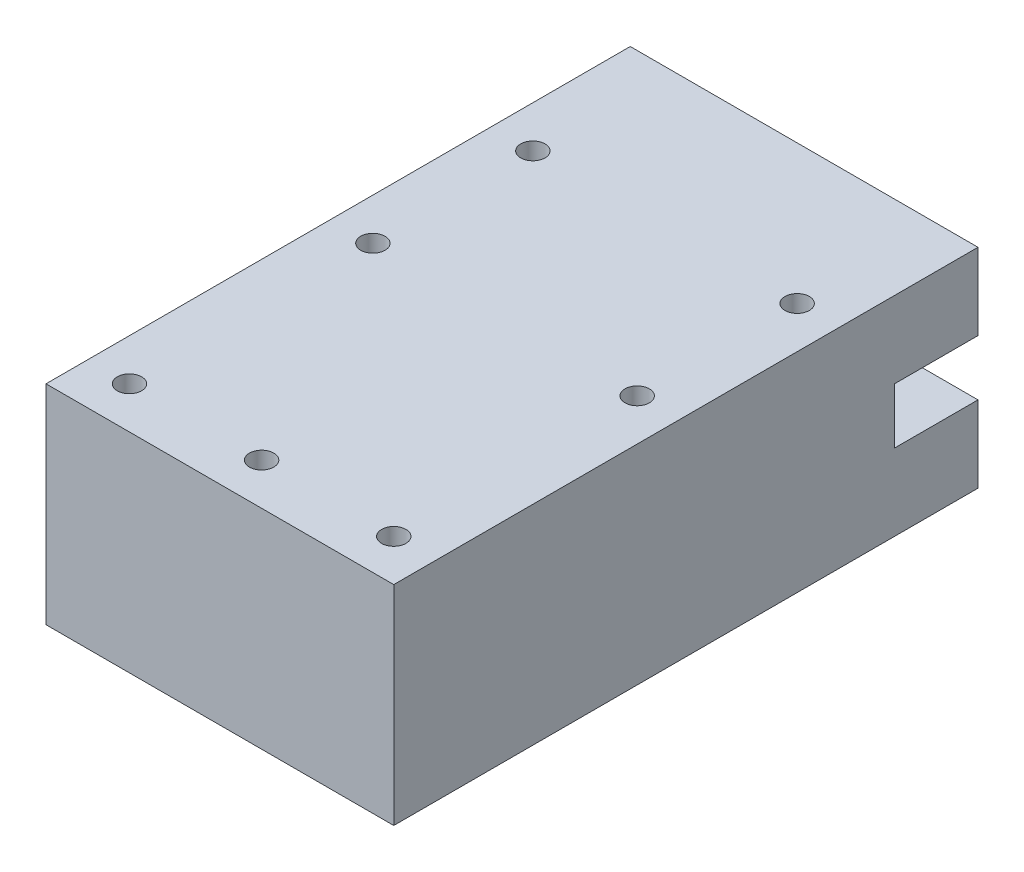
ISO-10303-21;
HEADER;
FILE_DESCRIPTION(('STEP AP214'),'2;1');
FILE_NAME('part.step','',(''),(''),'','','');
FILE_SCHEMA(('AUTOMOTIVE_DESIGN { 1 0 10303 214 1 1 1 1 }'));
ENDSEC;
DATA;
#1=APPLICATION_CONTEXT('core data for automotive mechanical design processes');
#2=APPLICATION_PROTOCOL_DEFINITION('international standard','automotive_design',2000,#1);
#3=PRODUCT_CONTEXT('',#1,'mechanical');
#4=PRODUCT('Part','Part','',(#3));
#5=PRODUCT_RELATED_PRODUCT_CATEGORY('part','',(#4));
#6=PRODUCT_DEFINITION_FORMATION('','',#4);
#7=PRODUCT_DEFINITION_CONTEXT('part definition',#1,'design');
#8=PRODUCT_DEFINITION('design','',#6,#7);
#9=PRODUCT_DEFINITION_SHAPE('','',#8);
#10=(LENGTH_UNIT() NAMED_UNIT(*) SI_UNIT(.MILLI.,.METRE.));
#11=(NAMED_UNIT(*) PLANE_ANGLE_UNIT() SI_UNIT($,.RADIAN.));
#12=(NAMED_UNIT(*) SI_UNIT($,.STERADIAN.) SOLID_ANGLE_UNIT());
#13=UNCERTAINTY_MEASURE_WITH_UNIT(LENGTH_MEASURE(1.E-05),#10,'distance_accuracy_value','');
#14=(GEOMETRIC_REPRESENTATION_CONTEXT(3) GLOBAL_UNCERTAINTY_ASSIGNED_CONTEXT((#13)) GLOBAL_UNIT_ASSIGNED_CONTEXT((#10,
#11,#12)) REPRESENTATION_CONTEXT('',''));
#15=CARTESIAN_POINT('',(0.,0.,0.));
#16=DIRECTION('',(0.,0.,1.));
#17=DIRECTION('',(1.,0.,0.));
#18=AXIS2_PLACEMENT_3D('',#15,#16,#17);
#19=CARTESIAN_POINT('',(0.,0.,0.));
#20=DIRECTION('',(0.,0.,1.));
#21=DIRECTION('',(1.,0.,0.));
#22=AXIS2_PLACEMENT_3D('',#19,#20,#21);
#23=PLANE('',#22);
#24=DIRECTION('',(0.,-1.,0.));
#25=VECTOR('',#24,1.);
#26=CARTESIAN_POINT('',(-25.,15.,0.));
#27=LINE('',#26,#25);
#28=CARTESIAN_POINT('',(-25.,-4.,0.));
#29=VERTEX_POINT('',#28);
#30=CARTESIAN_POINT('',(-25.,-15.,0.));
#31=VERTEX_POINT('',#30);
#32=EDGE_CURVE('E171',#29,#31,#27,.T.);
#33=ORIENTED_EDGE('',*,*,#32,.F.);
#34=DIRECTION('',(1.,0.,0.));
#35=VECTOR('',#34,1.);
#36=CARTESIAN_POINT('',(-25.,-4.,0.));
#37=LINE('',#36,#35);
#38=CARTESIAN_POINT('',(-13.,-4.,0.));
#39=VERTEX_POINT('',#38);
#40=EDGE_CURVE('E261',#29,#39,#37,.T.);
#41=ORIENTED_EDGE('',*,*,#40,.T.);
#42=DIRECTION('',(0.,1.,0.));
#43=VECTOR('',#42,1.);
#44=CARTESIAN_POINT('',(-13.,7.,0.));
#45=LINE('',#44,#43);
#46=CARTESIAN_POINT('',(-13.,-7.,0.));
#47=VERTEX_POINT('',#46);
#48=EDGE_CURVE('E224',#47,#39,#45,.T.);
#49=ORIENTED_EDGE('',*,*,#48,.F.);
#50=DIRECTION('',(-1.,0.,0.));
#51=VECTOR('',#50,1.);
#52=CARTESIAN_POINT('',(-13.,-7.,0.));
#53=LINE('',#52,#51);
#54=CARTESIAN_POINT('',(13.,-7.,0.));
#55=VERTEX_POINT('',#54);
#56=EDGE_CURVE('E227',#55,#47,#53,.T.);
#57=ORIENTED_EDGE('',*,*,#56,.F.);
#58=DIRECTION('',(0.,-1.,0.));
#59=VECTOR('',#58,1.);
#60=CARTESIAN_POINT('',(13.,7.,0.));
#61=LINE('',#60,#59);
#62=CARTESIAN_POINT('',(13.,-4.,0.));
#63=VERTEX_POINT('',#62);
#64=EDGE_CURVE('E233',#63,#55,#61,.T.);
#65=ORIENTED_EDGE('',*,*,#64,.F.);
#66=DIRECTION('',(-1.,0.,0.));
#67=VECTOR('',#66,1.);
#68=CARTESIAN_POINT('',(25.,-4.,0.));
#69=LINE('',#68,#67);
#70=CARTESIAN_POINT('',(25.,-4.,0.));
#71=VERTEX_POINT('',#70);
#72=EDGE_CURVE('E56',#71,#63,#69,.T.);
#73=ORIENTED_EDGE('',*,*,#72,.F.);
#74=DIRECTION('',(0.,1.,0.));
#75=VECTOR('',#74,1.);
#76=CARTESIAN_POINT('',(25.,15.,0.));
#77=LINE('',#76,#75);
#78=CARTESIAN_POINT('',(25.,-15.,0.));
#79=VERTEX_POINT('',#78);
#80=EDGE_CURVE('E196',#79,#71,#77,.T.);
#81=ORIENTED_EDGE('',*,*,#80,.F.);
#82=DIRECTION('',(1.,0.,0.));
#83=VECTOR('',#82,1.);
#84=CARTESIAN_POINT('',(-25.,-15.,0.));
#85=LINE('',#84,#83);
#86=EDGE_CURVE('E170',#31,#79,#85,.T.);
#87=ORIENTED_EDGE('',*,*,#86,.F.);
#88=EDGE_LOOP('',(#33,#41,#49,#57,#65,#73,#81,#87));
#89=FACE_BOUND('',#88,.T.);
#90=ADVANCED_FACE('F33',(#89),#23,.F.);
#91=CARTESIAN_POINT('',(25.,15.,84.));
#92=DIRECTION('',(-1.,0.,0.));
#93=DIRECTION('',(0.,-1.,0.));
#94=AXIS2_PLACEMENT_3D('',#91,#92,#93);
#95=PLANE('',#94);
#96=DIRECTION('',(0.,1.,0.));
#97=VECTOR('',#96,1.);
#98=CARTESIAN_POINT('',(25.,4.,12.));
#99=LINE('',#98,#97);
#100=CARTESIAN_POINT('',(25.,-4.,12.));
#101=VERTEX_POINT('',#100);
#102=CARTESIAN_POINT('',(25.,4.,12.));
#103=VERTEX_POINT('',#102);
#104=EDGE_CURVE('E264',#101,#103,#99,.T.);
#105=ORIENTED_EDGE('',*,*,#104,.T.);
#106=DIRECTION('',(0.,0.,-1.));
#107=VECTOR('',#106,1.);
#108=CARTESIAN_POINT('',(25.,4.,0.));
#109=LINE('',#108,#107);
#110=CARTESIAN_POINT('',(25.,4.,0.));
#111=VERTEX_POINT('',#110);
#112=EDGE_CURVE('E246',#103,#111,#109,.T.);
#113=ORIENTED_EDGE('',*,*,#112,.T.);
#114=CARTESIAN_POINT('',(25.,15.,0.));
#115=VERTEX_POINT('',#114);
#116=EDGE_CURVE('E200',#111,#115,#77,.T.);
#117=ORIENTED_EDGE('',*,*,#116,.T.);
#118=DIRECTION('',(0.,0.,-1.));
#119=VECTOR('',#118,1.);
#120=CARTESIAN_POINT('',(25.,15.,84.));
#121=LINE('',#120,#119);
#122=CARTESIAN_POINT('',(25.,15.,84.));
#123=VERTEX_POINT('',#122);
#124=EDGE_CURVE('E11',#123,#115,#121,.T.);
#125=ORIENTED_EDGE('',*,*,#124,.F.);
#126=DIRECTION('',(0.,1.,0.));
#127=VECTOR('',#126,1.);
#128=CARTESIAN_POINT('',(25.,15.,84.));
#129=LINE('',#128,#127);
#130=CARTESIAN_POINT('',(25.,-15.,84.));
#131=VERTEX_POINT('',#130);
#132=EDGE_CURVE('E173',#131,#123,#129,.T.);
#133=ORIENTED_EDGE('',*,*,#132,.F.);
#134=DIRECTION('',(0.,0.,-1.));
#135=VECTOR('',#134,1.);
#136=CARTESIAN_POINT('',(25.,-15.,84.));
#137=LINE('',#136,#135);
#138=EDGE_CURVE('E179',#131,#79,#137,.T.);
#139=ORIENTED_EDGE('',*,*,#138,.T.);
#140=ORIENTED_EDGE('',*,*,#80,.T.);
#141=DIRECTION('',(0.,0.,1.));
#142=VECTOR('',#141,1.);
#143=CARTESIAN_POINT('',(25.,-4.,0.));
#144=LINE('',#143,#142);
#145=EDGE_CURVE('E255',#71,#101,#144,.T.);
#146=ORIENTED_EDGE('',*,*,#145,.T.);
#147=EDGE_LOOP('',(#105,#113,#117,#125,#133,#139,#140,#146));
#148=FACE_BOUND('',#147,.T.);
#149=ADVANCED_FACE('F35',(#148),#95,.F.);
#150=CARTESIAN_POINT('',(-25.,15.,84.));
#151=DIRECTION('',(0.,-1.,0.));
#152=DIRECTION('',(0.,0.,-1.));
#153=AXIS2_PLACEMENT_3D('',#150,#151,#152);
#154=PLANE('',#153);
#155=CARTESIAN_POINT('',(19.,15.,43.));
#156=DIRECTION('',(0.,1.,0.));
#157=DIRECTION('',(0.,0.,1.));
#158=AXIS2_PLACEMENT_3D('',#155,#156,#157);
#159=CIRCLE('',#158,1.75);
#160=CARTESIAN_POINT('',(19.,15.,44.75));
#161=VERTEX_POINT('',#160);
#162=EDGE_CURVE('E307',#161,#161,#159,.T.);
#163=ORIENTED_EDGE('',*,*,#162,.F.);
#164=EDGE_LOOP('',(#163));
#165=FACE_BOUND('',#164,.T.);
#166=CARTESIAN_POINT('',(19.,15.,78.));
#167=DIRECTION('',(0.,1.,0.));
#168=DIRECTION('',(0.,0.,1.));
#169=AXIS2_PLACEMENT_3D('',#166,#167,#168);
#170=CIRCLE('',#169,1.75);
#171=CARTESIAN_POINT('',(19.,15.,79.75));
#172=VERTEX_POINT('',#171);
#173=EDGE_CURVE('E301',#172,#172,#170,.T.);
#174=ORIENTED_EDGE('',*,*,#173,.F.);
#175=EDGE_LOOP('',(#174));
#176=FACE_BOUND('',#175,.T.);
#177=CARTESIAN_POINT('',(0.,15.,78.));
#178=DIRECTION('',(0.,1.,0.));
#179=DIRECTION('',(0.,0.,1.));
#180=AXIS2_PLACEMENT_3D('',#177,#178,#179);
#181=CIRCLE('',#180,1.75);
#182=CARTESIAN_POINT('',(0.,15.,79.75));
#183=VERTEX_POINT('',#182);
#184=EDGE_CURVE('E295',#183,#183,#181,.T.);
#185=ORIENTED_EDGE('',*,*,#184,.F.);
#186=EDGE_LOOP('',(#185));
#187=FACE_BOUND('',#186,.T.);
#188=CARTESIAN_POINT('',(-19.,15.,78.));
#189=DIRECTION('',(0.,1.,0.));
#190=DIRECTION('',(0.,0.,1.));
#191=AXIS2_PLACEMENT_3D('',#188,#189,#190);
#192=CIRCLE('',#191,1.75);
#193=CARTESIAN_POINT('',(-19.,15.,79.75));
#194=VERTEX_POINT('',#193);
#195=EDGE_CURVE('E288',#194,#194,#192,.T.);
#196=ORIENTED_EDGE('',*,*,#195,.F.);
#197=EDGE_LOOP('',(#196));
#198=FACE_BOUND('',#197,.T.);
#199=CARTESIAN_POINT('',(-19.,15.,43.));
#200=DIRECTION('',(0.,1.,0.));
#201=DIRECTION('',(0.,0.,1.));
#202=AXIS2_PLACEMENT_3D('',#199,#200,#201);
#203=CIRCLE('',#202,1.75);
#204=CARTESIAN_POINT('',(-19.,15.,44.75));
#205=VERTEX_POINT('',#204);
#206=EDGE_CURVE('E318',#205,#205,#203,.T.);
#207=ORIENTED_EDGE('',*,*,#206,.F.);
#208=EDGE_LOOP('',(#207));
#209=FACE_BOUND('',#208,.T.);
#210=CARTESIAN_POINT('',(-19.,15.,20.));
#211=DIRECTION('',(0.,1.,0.));
#212=DIRECTION('',(0.,0.,1.));
#213=AXIS2_PLACEMENT_3D('',#210,#211,#212);
#214=CIRCLE('',#213,1.75);
#215=CARTESIAN_POINT('',(-19.,15.,21.75));
#216=VERTEX_POINT('',#215);
#217=EDGE_CURVE('E312',#216,#216,#214,.T.);
#218=ORIENTED_EDGE('',*,*,#217,.F.);
#219=EDGE_LOOP('',(#218));
#220=FACE_BOUND('',#219,.T.);
#221=CARTESIAN_POINT('',(19.,15.,20.));
#222=DIRECTION('',(0.,1.,0.));
#223=DIRECTION('',(0.,0.,1.));
#224=AXIS2_PLACEMENT_3D('',#221,#222,#223);
#225=CIRCLE('',#224,1.75);
#226=CARTESIAN_POINT('',(19.,15.,21.75));
#227=VERTEX_POINT('',#226);
#228=EDGE_CURVE('E282',#227,#227,#225,.T.);
#229=ORIENTED_EDGE('',*,*,#228,.F.);
#230=EDGE_LOOP('',(#229));
#231=FACE_BOUND('',#230,.T.);
#232=DIRECTION('',(-1.,0.,0.));
#233=VECTOR('',#232,1.);
#234=CARTESIAN_POINT('',(-25.,15.,0.));
#235=LINE('',#234,#233);
#236=CARTESIAN_POINT('',(-25.,15.,0.));
#237=VERTEX_POINT('',#236);
#238=EDGE_CURVE('E175',#115,#237,#235,.T.);
#239=ORIENTED_EDGE('',*,*,#238,.T.);
#240=DIRECTION('',(0.,0.,-1.));
#241=VECTOR('',#240,1.);
#242=CARTESIAN_POINT('',(-25.,15.,84.));
#243=LINE('',#242,#241);
#244=CARTESIAN_POINT('',(-25.,15.,84.));
#245=VERTEX_POINT('',#244);
#246=EDGE_CURVE('E41',#245,#237,#243,.T.);
#247=ORIENTED_EDGE('',*,*,#246,.F.);
#248=DIRECTION('',(-1.,0.,0.));
#249=VECTOR('',#248,1.);
#250=CARTESIAN_POINT('',(-25.,15.,84.));
#251=LINE('',#250,#249);
#252=EDGE_CURVE('E206',#123,#245,#251,.T.);
#253=ORIENTED_EDGE('',*,*,#252,.F.);
#254=ORIENTED_EDGE('',*,*,#124,.T.);
#255=EDGE_LOOP('',(#239,#247,#253,#254));
#256=FACE_BOUND('',#255,.T.);
#257=ADVANCED_FACE('F334',(#165,#176,#187,#198,#209,#220,#231,#256),#154,.F.);
#258=CARTESIAN_POINT('',(-25.,15.,84.));
#259=DIRECTION('',(1.,0.,0.));
#260=DIRECTION('',(0.,0.,-1.));
#261=AXIS2_PLACEMENT_3D('',#258,#259,#260);
#262=PLANE('',#261);
#263=DIRECTION('',(0.,-1.,0.));
#264=VECTOR('',#263,1.);
#265=CARTESIAN_POINT('',(-25.,4.,12.));
#266=LINE('',#265,#264);
#267=CARTESIAN_POINT('',(-25.,4.,12.));
#268=VERTEX_POINT('',#267);
#269=CARTESIAN_POINT('',(-25.,-4.,12.));
#270=VERTEX_POINT('',#269);
#271=EDGE_CURVE('E153',#268,#270,#266,.T.);
#272=ORIENTED_EDGE('',*,*,#271,.T.);
#273=DIRECTION('',(0.,0.,-1.));
#274=VECTOR('',#273,1.);
#275=CARTESIAN_POINT('',(-25.,-4.,0.));
#276=LINE('',#275,#274);
#277=EDGE_CURVE('E164',#270,#29,#276,.T.);
#278=ORIENTED_EDGE('',*,*,#277,.T.);
#279=ORIENTED_EDGE('',*,*,#32,.T.);
#280=DIRECTION('',(0.,0.,-1.));
#281=VECTOR('',#280,1.);
#282=CARTESIAN_POINT('',(-25.,-15.,84.));
#283=LINE('',#282,#281);
#284=CARTESIAN_POINT('',(-25.,-15.,84.));
#285=VERTEX_POINT('',#284);
#286=EDGE_CURVE('E182',#285,#31,#283,.T.);
#287=ORIENTED_EDGE('',*,*,#286,.F.);
#288=DIRECTION('',(0.,-1.,0.));
#289=VECTOR('',#288,1.);
#290=CARTESIAN_POINT('',(-25.,15.,84.));
#291=LINE('',#290,#289);
#292=EDGE_CURVE('E204',#245,#285,#291,.T.);
#293=ORIENTED_EDGE('',*,*,#292,.F.);
#294=ORIENTED_EDGE('',*,*,#246,.T.);
#295=CARTESIAN_POINT('',(-25.,4.,0.));
#296=VERTEX_POINT('',#295);
#297=EDGE_CURVE('E161',#237,#296,#27,.T.);
#298=ORIENTED_EDGE('',*,*,#297,.T.);
#299=DIRECTION('',(0.,0.,1.));
#300=VECTOR('',#299,1.);
#301=CARTESIAN_POINT('',(-25.,4.,0.));
#302=LINE('',#301,#300);
#303=EDGE_CURVE('E146',#296,#268,#302,.T.);
#304=ORIENTED_EDGE('',*,*,#303,.T.);
#305=EDGE_LOOP('',(#272,#278,#279,#287,#293,#294,#298,#304));
#306=FACE_BOUND('',#305,.T.);
#307=ADVANCED_FACE('F167',(#306),#262,.F.);
#308=CARTESIAN_POINT('',(-25.,-15.,84.));
#309=DIRECTION('',(0.,1.,0.));
#310=DIRECTION('',(0.,0.,1.));
#311=AXIS2_PLACEMENT_3D('',#308,#309,#310);
#312=PLANE('',#311);
#313=CARTESIAN_POINT('',(19.,-15.,43.));
#314=DIRECTION('',(0.,1.,0.));
#315=DIRECTION('',(0.,0.,1.));
#316=AXIS2_PLACEMENT_3D('',#313,#314,#315);
#317=CIRCLE('',#316,1.75);
#318=CARTESIAN_POINT('',(19.,-15.,44.75));
#319=VERTEX_POINT('',#318);
#320=EDGE_CURVE('E285',#319,#319,#317,.T.);
#321=ORIENTED_EDGE('',*,*,#320,.T.);
#322=EDGE_LOOP('',(#321));
#323=FACE_BOUND('',#322,.T.);
#324=CARTESIAN_POINT('',(19.,-15.,78.));
#325=DIRECTION('',(0.,1.,0.));
#326=DIRECTION('',(0.,0.,1.));
#327=AXIS2_PLACEMENT_3D('',#324,#325,#326);
#328=CIRCLE('',#327,1.75);
#329=CARTESIAN_POINT('',(19.,-15.,79.75));
#330=VERTEX_POINT('',#329);
#331=EDGE_CURVE('E304',#330,#330,#328,.T.);
#332=ORIENTED_EDGE('',*,*,#331,.T.);
#333=EDGE_LOOP('',(#332));
#334=FACE_BOUND('',#333,.T.);
#335=CARTESIAN_POINT('',(0.,-15.,78.));
#336=DIRECTION('',(0.,1.,0.));
#337=DIRECTION('',(0.,0.,1.));
#338=AXIS2_PLACEMENT_3D('',#335,#336,#337);
#339=CIRCLE('',#338,1.75);
#340=CARTESIAN_POINT('',(0.,-15.,79.75));
#341=VERTEX_POINT('',#340);
#342=EDGE_CURVE('E298',#341,#341,#339,.T.);
#343=ORIENTED_EDGE('',*,*,#342,.T.);
#344=EDGE_LOOP('',(#343));
#345=FACE_BOUND('',#344,.T.);
#346=CARTESIAN_POINT('',(-19.,-15.,78.));
#347=DIRECTION('',(0.,1.,0.));
#348=DIRECTION('',(0.,0.,1.));
#349=AXIS2_PLACEMENT_3D('',#346,#347,#348);
#350=CIRCLE('',#349,1.75);
#351=CARTESIAN_POINT('',(-19.,-15.,79.75));
#352=VERTEX_POINT('',#351);
#353=EDGE_CURVE('E291',#352,#352,#350,.T.);
#354=ORIENTED_EDGE('',*,*,#353,.T.);
#355=EDGE_LOOP('',(#354));
#356=FACE_BOUND('',#355,.T.);
#357=CARTESIAN_POINT('',(-19.,-15.,43.));
#358=DIRECTION('',(0.,1.,0.));
#359=DIRECTION('',(0.,0.,1.));
#360=AXIS2_PLACEMENT_3D('',#357,#358,#359);
#361=CIRCLE('',#360,1.75);
#362=CARTESIAN_POINT('',(-19.,-15.,44.75));
#363=VERTEX_POINT('',#362);
#364=EDGE_CURVE('E292',#363,#363,#361,.T.);
#365=ORIENTED_EDGE('',*,*,#364,.T.);
#366=EDGE_LOOP('',(#365));
#367=FACE_BOUND('',#366,.T.);
#368=CARTESIAN_POINT('',(-19.,-15.,20.));
#369=DIRECTION('',(0.,1.,0.));
#370=DIRECTION('',(0.,0.,1.));
#371=AXIS2_PLACEMENT_3D('',#368,#369,#370);
#372=CIRCLE('',#371,1.75);
#373=CARTESIAN_POINT('',(-19.,-15.,21.75));
#374=VERTEX_POINT('',#373);
#375=EDGE_CURVE('E315',#374,#374,#372,.T.);
#376=ORIENTED_EDGE('',*,*,#375,.T.);
#377=EDGE_LOOP('',(#376));
#378=FACE_BOUND('',#377,.T.);
#379=CARTESIAN_POINT('',(19.,-15.,20.));
#380=DIRECTION('',(0.,1.,0.));
#381=DIRECTION('',(0.,0.,1.));
#382=AXIS2_PLACEMENT_3D('',#379,#380,#381);
#383=CIRCLE('',#382,1.75);
#384=CARTESIAN_POINT('',(19.,-15.,21.75));
#385=VERTEX_POINT('',#384);
#386=EDGE_CURVE('E278',#385,#385,#383,.T.);
#387=ORIENTED_EDGE('',*,*,#386,.T.);
#388=EDGE_LOOP('',(#387));
#389=FACE_BOUND('',#388,.T.);
#390=ORIENTED_EDGE('',*,*,#86,.T.);
#391=ORIENTED_EDGE('',*,*,#138,.F.);
#392=DIRECTION('',(1.,0.,0.));
#393=VECTOR('',#392,1.);
#394=CARTESIAN_POINT('',(-25.,-15.,84.));
#395=LINE('',#394,#393);
#396=EDGE_CURVE('E183',#285,#131,#395,.T.);
#397=ORIENTED_EDGE('',*,*,#396,.F.);
#398=ORIENTED_EDGE('',*,*,#286,.T.);
#399=EDGE_LOOP('',(#390,#391,#397,#398));
#400=FACE_BOUND('',#399,.T.);
#401=ADVANCED_FACE('F189',(#323,#334,#345,#356,#367,#378,#389,#400),#312,.F.);
#402=CARTESIAN_POINT('',(0.,0.,84.));
#403=DIRECTION('',(0.,0.,1.));
#404=DIRECTION('',(1.,0.,0.));
#405=AXIS2_PLACEMENT_3D('',#402,#403,#404);
#406=PLANE('',#405);
#407=ORIENTED_EDGE('',*,*,#132,.T.);
#408=ORIENTED_EDGE('',*,*,#252,.T.);
#409=ORIENTED_EDGE('',*,*,#292,.T.);
#410=ORIENTED_EDGE('',*,*,#396,.T.);
#411=EDGE_LOOP('',(#407,#408,#409,#410));
#412=FACE_BOUND('',#411,.T.);
#413=ADVANCED_FACE('F393',(#412),#406,.T.);
#414=CARTESIAN_POINT('',(-13.,4.,0.));
#415=VERTEX_POINT('',#414);
#416=CARTESIAN_POINT('',(-13.,7.,0.));
#417=VERTEX_POINT('',#416);
#418=EDGE_CURVE('E163',#415,#417,#45,.T.);
#419=ORIENTED_EDGE('',*,*,#418,.F.);
#420=DIRECTION('',(1.,0.,0.));
#421=VECTOR('',#420,1.);
#422=CARTESIAN_POINT('',(-25.,4.,0.));
#423=LINE('',#422,#421);
#424=EDGE_CURVE('E48',#296,#415,#423,.T.);
#425=ORIENTED_EDGE('',*,*,#424,.F.);
#426=ORIENTED_EDGE('',*,*,#297,.F.);
#427=ORIENTED_EDGE('',*,*,#238,.F.);
#428=ORIENTED_EDGE('',*,*,#116,.F.);
#429=DIRECTION('',(-1.,0.,0.));
#430=VECTOR('',#429,1.);
#431=CARTESIAN_POINT('',(25.,4.,0.));
#432=LINE('',#431,#430);
#433=CARTESIAN_POINT('',(13.,4.,0.));
#434=VERTEX_POINT('',#433);
#435=EDGE_CURVE('E250',#111,#434,#432,.T.);
#436=ORIENTED_EDGE('',*,*,#435,.T.);
#437=CARTESIAN_POINT('',(13.,7.,0.));
#438=VERTEX_POINT('',#437);
#439=EDGE_CURVE('E230',#438,#434,#61,.T.);
#440=ORIENTED_EDGE('',*,*,#439,.F.);
#441=DIRECTION('',(1.,0.,0.));
#442=VECTOR('',#441,1.);
#443=CARTESIAN_POINT('',(-13.,7.,0.));
#444=LINE('',#443,#442);
#445=EDGE_CURVE('E220',#417,#438,#444,.T.);
#446=ORIENTED_EDGE('',*,*,#445,.F.);
#447=EDGE_LOOP('',(#419,#425,#426,#427,#428,#436,#440,#446));
#448=FACE_BOUND('',#447,.T.);
#449=ADVANCED_FACE('F159',(#448),#23,.F.);
#450=CARTESIAN_POINT('',(13.,7.,72.));
#451=DIRECTION('',(1.,0.,0.));
#452=DIRECTION('',(0.,1.,0.));
#453=AXIS2_PLACEMENT_3D('',#450,#451,#452);
#454=PLANE('',#453);
#455=ORIENTED_EDGE('',*,*,#439,.T.);
#456=DIRECTION('',(0.,0.,-1.));
#457=VECTOR('',#456,1.);
#458=CARTESIAN_POINT('',(13.,4.,0.));
#459=LINE('',#458,#457);
#460=CARTESIAN_POINT('',(13.,4.,12.));
#461=VERTEX_POINT('',#460);
#462=EDGE_CURVE('E253',#461,#434,#459,.T.);
#463=ORIENTED_EDGE('',*,*,#462,.F.);
#464=DIRECTION('',(0.,1.,0.));
#465=VECTOR('',#464,1.);
#466=CARTESIAN_POINT('',(13.,4.,12.));
#467=LINE('',#466,#465);
#468=CARTESIAN_POINT('',(13.,-4.,12.));
#469=VERTEX_POINT('',#468);
#470=EDGE_CURVE('E256',#469,#461,#467,.T.);
#471=ORIENTED_EDGE('',*,*,#470,.F.);
#472=DIRECTION('',(0.,0.,1.));
#473=VECTOR('',#472,1.);
#474=CARTESIAN_POINT('',(13.,-4.,0.));
#475=LINE('',#474,#473);
#476=EDGE_CURVE('E259',#63,#469,#475,.T.);
#477=ORIENTED_EDGE('',*,*,#476,.F.);
#478=ORIENTED_EDGE('',*,*,#64,.T.);
#479=DIRECTION('',(0.,0.,-1.));
#480=VECTOR('',#479,1.);
#481=CARTESIAN_POINT('',(13.,-7.,72.));
#482=LINE('',#481,#480);
#483=CARTESIAN_POINT('',(13.,-7.,72.));
#484=VERTEX_POINT('',#483);
#485=EDGE_CURVE('E210',#484,#55,#482,.T.);
#486=ORIENTED_EDGE('',*,*,#485,.F.);
#487=DIRECTION('',(0.,-1.,0.));
#488=VECTOR('',#487,1.);
#489=CARTESIAN_POINT('',(13.,7.,72.));
#490=LINE('',#489,#488);
#491=CARTESIAN_POINT('',(13.,7.,72.));
#492=VERTEX_POINT('',#491);
#493=EDGE_CURVE('E223',#492,#484,#490,.T.);
#494=ORIENTED_EDGE('',*,*,#493,.F.);
#495=DIRECTION('',(0.,0.,-1.));
#496=VECTOR('',#495,1.);
#497=CARTESIAN_POINT('',(13.,7.,72.));
#498=LINE('',#497,#496);
#499=EDGE_CURVE('E201',#492,#438,#498,.T.);
#500=ORIENTED_EDGE('',*,*,#499,.T.);
#501=EDGE_LOOP('',(#455,#463,#471,#477,#478,#486,#494,#500));
#502=FACE_BOUND('',#501,.T.);
#503=ADVANCED_FACE('F353',(#502),#454,.F.);
#504=CARTESIAN_POINT('',(-13.,7.,72.));
#505=DIRECTION('',(0.,1.,0.));
#506=DIRECTION('',(-1.,0.,0.));
#507=AXIS2_PLACEMENT_3D('',#504,#505,#506);
#508=PLANE('',#507);
#509=ORIENTED_EDGE('',*,*,#445,.T.);
#510=ORIENTED_EDGE('',*,*,#499,.F.);
#511=DIRECTION('',(1.,0.,0.));
#512=VECTOR('',#511,1.);
#513=CARTESIAN_POINT('',(-13.,7.,72.));
#514=LINE('',#513,#512);
#515=CARTESIAN_POINT('',(-13.,7.,72.));
#516=VERTEX_POINT('',#515);
#517=EDGE_CURVE('E214',#516,#492,#514,.T.);
#518=ORIENTED_EDGE('',*,*,#517,.F.);
#519=DIRECTION('',(0.,0.,-1.));
#520=VECTOR('',#519,1.);
#521=CARTESIAN_POINT('',(-13.,7.,72.));
#522=LINE('',#521,#520);
#523=EDGE_CURVE('E216',#516,#417,#522,.T.);
#524=ORIENTED_EDGE('',*,*,#523,.T.);
#525=EDGE_LOOP('',(#509,#510,#518,#524));
#526=FACE_BOUND('',#525,.T.);
#527=ADVANCED_FACE('F356',(#526),#508,.F.);
#528=CARTESIAN_POINT('',(-13.,7.,72.));
#529=DIRECTION('',(-1.,0.,0.));
#530=DIRECTION('',(0.,-1.,0.));
#531=AXIS2_PLACEMENT_3D('',#528,#529,#530);
#532=PLANE('',#531);
#533=ORIENTED_EDGE('',*,*,#48,.T.);
#534=DIRECTION('',(0.,0.,-1.));
#535=VECTOR('',#534,1.);
#536=CARTESIAN_POINT('',(-13.,-4.,0.));
#537=LINE('',#536,#535);
#538=CARTESIAN_POINT('',(-13.,-4.,12.));
#539=VERTEX_POINT('',#538);
#540=EDGE_CURVE('E154',#539,#39,#537,.T.);
#541=ORIENTED_EDGE('',*,*,#540,.F.);
#542=DIRECTION('',(0.,-1.,0.));
#543=VECTOR('',#542,1.);
#544=CARTESIAN_POINT('',(-13.,4.,12.));
#545=LINE('',#544,#543);
#546=CARTESIAN_POINT('',(-13.,4.,12.));
#547=VERTEX_POINT('',#546);
#548=EDGE_CURVE('E273',#547,#539,#545,.T.);
#549=ORIENTED_EDGE('',*,*,#548,.F.);
#550=DIRECTION('',(0.,0.,1.));
#551=VECTOR('',#550,1.);
#552=CARTESIAN_POINT('',(-13.,4.,0.));
#553=LINE('',#552,#551);
#554=EDGE_CURVE('E276',#415,#547,#553,.T.);
#555=ORIENTED_EDGE('',*,*,#554,.F.);
#556=ORIENTED_EDGE('',*,*,#418,.T.);
#557=ORIENTED_EDGE('',*,*,#523,.F.);
#558=DIRECTION('',(0.,1.,0.));
#559=VECTOR('',#558,1.);
#560=CARTESIAN_POINT('',(-13.,7.,72.));
#561=LINE('',#560,#559);
#562=CARTESIAN_POINT('',(-13.,-7.,72.));
#563=VERTEX_POINT('',#562);
#564=EDGE_CURVE('E236',#563,#516,#561,.T.);
#565=ORIENTED_EDGE('',*,*,#564,.F.);
#566=DIRECTION('',(0.,0.,-1.));
#567=VECTOR('',#566,1.);
#568=CARTESIAN_POINT('',(-13.,-7.,72.));
#569=LINE('',#568,#567);
#570=EDGE_CURVE('E213',#563,#47,#569,.T.);
#571=ORIENTED_EDGE('',*,*,#570,.T.);
#572=EDGE_LOOP('',(#533,#541,#549,#555,#556,#557,#565,#571));
#573=FACE_BOUND('',#572,.T.);
#574=ADVANCED_FACE('F360',(#573),#532,.F.);
#575=CARTESIAN_POINT('',(-13.,-7.,72.));
#576=DIRECTION('',(0.,-1.,0.));
#577=DIRECTION('',(1.,0.,0.));
#578=AXIS2_PLACEMENT_3D('',#575,#576,#577);
#579=PLANE('',#578);
#580=ORIENTED_EDGE('',*,*,#56,.T.);
#581=ORIENTED_EDGE('',*,*,#570,.F.);
#582=DIRECTION('',(-1.,0.,0.));
#583=VECTOR('',#582,1.);
#584=CARTESIAN_POINT('',(-13.,-7.,72.));
#585=LINE('',#584,#583);
#586=EDGE_CURVE('E239',#484,#563,#585,.T.);
#587=ORIENTED_EDGE('',*,*,#586,.F.);
#588=ORIENTED_EDGE('',*,*,#485,.T.);
#589=EDGE_LOOP('',(#580,#581,#587,#588));
#590=FACE_BOUND('',#589,.T.);
#591=ADVANCED_FACE('F365',(#590),#579,.F.);
#592=CARTESIAN_POINT('',(0.,0.,72.));
#593=DIRECTION('',(0.,0.,1.));
#594=DIRECTION('',(1.,0.,0.));
#595=AXIS2_PLACEMENT_3D('',#592,#593,#594);
#596=PLANE('',#595);
#597=ORIENTED_EDGE('',*,*,#493,.T.);
#598=ORIENTED_EDGE('',*,*,#586,.T.);
#599=ORIENTED_EDGE('',*,*,#564,.T.);
#600=ORIENTED_EDGE('',*,*,#517,.T.);
#601=EDGE_LOOP('',(#597,#598,#599,#600));
#602=FACE_BOUND('',#601,.T.);
#603=ADVANCED_FACE('F362',(#602),#596,.F.);
#604=CARTESIAN_POINT('',(25.,4.,0.));
#605=DIRECTION('',(0.,1.,0.));
#606=DIRECTION('',(-1.,0.,0.));
#607=AXIS2_PLACEMENT_3D('',#604,#605,#606);
#608=PLANE('',#607);
#609=ORIENTED_EDGE('',*,*,#462,.T.);
#610=ORIENTED_EDGE('',*,*,#435,.F.);
#611=ORIENTED_EDGE('',*,*,#112,.F.);
#612=DIRECTION('',(-1.,0.,0.));
#613=VECTOR('',#612,1.);
#614=CARTESIAN_POINT('',(25.,4.,12.));
#615=LINE('',#614,#613);
#616=EDGE_CURVE('E248',#103,#461,#615,.T.);
#617=ORIENTED_EDGE('',*,*,#616,.T.);
#618=EDGE_LOOP('',(#609,#610,#611,#617));
#619=FACE_BOUND('',#618,.T.);
#620=ADVANCED_FACE('F349',(#619),#608,.F.);
#621=CARTESIAN_POINT('',(25.,4.,12.));
#622=DIRECTION('',(0.,0.,1.));
#623=DIRECTION('',(0.,-1.,0.));
#624=AXIS2_PLACEMENT_3D('',#621,#622,#623);
#625=PLANE('',#624);
#626=ORIENTED_EDGE('',*,*,#470,.T.);
#627=ORIENTED_EDGE('',*,*,#616,.F.);
#628=ORIENTED_EDGE('',*,*,#104,.F.);
#629=DIRECTION('',(-1.,0.,0.));
#630=VECTOR('',#629,1.);
#631=CARTESIAN_POINT('',(25.,-4.,12.));
#632=LINE('',#631,#630);
#633=EDGE_CURVE('E245',#101,#469,#632,.T.);
#634=ORIENTED_EDGE('',*,*,#633,.T.);
#635=EDGE_LOOP('',(#626,#627,#628,#634));
#636=FACE_BOUND('',#635,.T.);
#637=ADVANCED_FACE('F415',(#636),#625,.F.);
#638=CARTESIAN_POINT('',(25.,-4.,0.));
#639=DIRECTION('',(0.,-1.,0.));
#640=DIRECTION('',(1.,0.,0.));
#641=AXIS2_PLACEMENT_3D('',#638,#639,#640);
#642=PLANE('',#641);
#643=ORIENTED_EDGE('',*,*,#476,.T.);
#644=ORIENTED_EDGE('',*,*,#633,.F.);
#645=ORIENTED_EDGE('',*,*,#145,.F.);
#646=ORIENTED_EDGE('',*,*,#72,.T.);
#647=EDGE_LOOP('',(#643,#644,#645,#646));
#648=FACE_BOUND('',#647,.T.);
#649=ADVANCED_FACE('F383',(#648),#642,.F.);
#650=CARTESIAN_POINT('',(-25.,-4.,0.));
#651=DIRECTION('',(0.,-1.,0.));
#652=DIRECTION('',(1.,0.,0.));
#653=AXIS2_PLACEMENT_3D('',#650,#651,#652);
#654=PLANE('',#653);
#655=ORIENTED_EDGE('',*,*,#540,.T.);
#656=ORIENTED_EDGE('',*,*,#40,.F.);
#657=ORIENTED_EDGE('',*,*,#277,.F.);
#658=DIRECTION('',(1.,0.,0.));
#659=VECTOR('',#658,1.);
#660=CARTESIAN_POINT('',(-25.,-4.,12.));
#661=LINE('',#660,#659);
#662=EDGE_CURVE('E269',#270,#539,#661,.T.);
#663=ORIENTED_EDGE('',*,*,#662,.T.);
#664=EDGE_LOOP('',(#655,#656,#657,#663));
#665=FACE_BOUND('',#664,.T.);
#666=ADVANCED_FACE('F372',(#665),#654,.F.);
#667=CARTESIAN_POINT('',(-25.,4.,12.));
#668=DIRECTION('',(0.,0.,1.));
#669=DIRECTION('',(1.,0.,0.));
#670=AXIS2_PLACEMENT_3D('',#667,#668,#669);
#671=PLANE('',#670);
#672=ORIENTED_EDGE('',*,*,#548,.T.);
#673=ORIENTED_EDGE('',*,*,#662,.F.);
#674=ORIENTED_EDGE('',*,*,#271,.F.);
#675=DIRECTION('',(1.,0.,0.));
#676=VECTOR('',#675,1.);
#677=CARTESIAN_POINT('',(-25.,4.,12.));
#678=LINE('',#677,#676);
#679=EDGE_CURVE('E148',#268,#547,#678,.T.);
#680=ORIENTED_EDGE('',*,*,#679,.T.);
#681=EDGE_LOOP('',(#672,#673,#674,#680));
#682=FACE_BOUND('',#681,.T.);
#683=ADVANCED_FACE('F374',(#682),#671,.F.);
#684=CARTESIAN_POINT('',(-25.,4.,0.));
#685=DIRECTION('',(0.,1.,0.));
#686=DIRECTION('',(-1.,0.,0.));
#687=AXIS2_PLACEMENT_3D('',#684,#685,#686);
#688=PLANE('',#687);
#689=ORIENTED_EDGE('',*,*,#554,.T.);
#690=ORIENTED_EDGE('',*,*,#679,.F.);
#691=ORIENTED_EDGE('',*,*,#303,.F.);
#692=ORIENTED_EDGE('',*,*,#424,.T.);
#693=EDGE_LOOP('',(#689,#690,#691,#692));
#694=FACE_BOUND('',#693,.T.);
#695=ADVANCED_FACE('F147',(#694),#688,.F.);
#696=CARTESIAN_POINT('',(19.,-15.,20.));
#697=DIRECTION('',(0.,1.,0.));
#698=DIRECTION('',(0.,0.,1.));
#699=AXIS2_PLACEMENT_3D('',#696,#697,#698);
#700=CYLINDRICAL_SURFACE('',#699,1.75);
#701=ORIENTED_EDGE('',*,*,#386,.F.);
#702=EDGE_LOOP('',(#701));
#703=FACE_BOUND('',#702,.T.);
#704=ORIENTED_EDGE('',*,*,#228,.T.);
#705=EDGE_LOOP('',(#704));
#706=FACE_BOUND('',#705,.T.);
#707=ADVANCED_FACE('F381',(#703,#706),#700,.F.);
#708=CARTESIAN_POINT('',(-19.,-15.,20.));
#709=DIRECTION('',(0.,1.,0.));
#710=DIRECTION('',(0.,0.,1.));
#711=AXIS2_PLACEMENT_3D('',#708,#709,#710);
#712=CYLINDRICAL_SURFACE('',#711,1.75);
#713=ORIENTED_EDGE('',*,*,#375,.F.);
#714=EDGE_LOOP('',(#713));
#715=FACE_BOUND('',#714,.T.);
#716=ORIENTED_EDGE('',*,*,#217,.T.);
#717=EDGE_LOOP('',(#716));
#718=FACE_BOUND('',#717,.T.);
#719=ADVANCED_FACE('F330',(#715,#718),#712,.F.);
#720=CARTESIAN_POINT('',(-19.,-15.,43.));
#721=DIRECTION('',(0.,1.,0.));
#722=DIRECTION('',(0.,0.,1.));
#723=AXIS2_PLACEMENT_3D('',#720,#721,#722);
#724=CYLINDRICAL_SURFACE('',#723,1.75);
#725=ORIENTED_EDGE('',*,*,#364,.F.);
#726=EDGE_LOOP('',(#725));
#727=FACE_BOUND('',#726,.T.);
#728=ORIENTED_EDGE('',*,*,#206,.T.);
#729=EDGE_LOOP('',(#728));
#730=FACE_BOUND('',#729,.T.);
#731=ADVANCED_FACE('F326',(#727,#730),#724,.F.);
#732=CARTESIAN_POINT('',(-19.,-15.,78.));
#733=DIRECTION('',(0.,1.,0.));
#734=DIRECTION('',(0.,0.,1.));
#735=AXIS2_PLACEMENT_3D('',#732,#733,#734);
#736=CYLINDRICAL_SURFACE('',#735,1.75);
#737=ORIENTED_EDGE('',*,*,#353,.F.);
#738=EDGE_LOOP('',(#737));
#739=FACE_BOUND('',#738,.T.);
#740=ORIENTED_EDGE('',*,*,#195,.T.);
#741=EDGE_LOOP('',(#740));
#742=FACE_BOUND('',#741,.T.);
#743=ADVANCED_FACE('F329',(#739,#742),#736,.F.);
#744=CARTESIAN_POINT('',(0.,-15.,78.));
#745=DIRECTION('',(0.,1.,0.));
#746=DIRECTION('',(0.,0.,1.));
#747=AXIS2_PLACEMENT_3D('',#744,#745,#746);
#748=CYLINDRICAL_SURFACE('',#747,1.75);
#749=ORIENTED_EDGE('',*,*,#342,.F.);
#750=EDGE_LOOP('',(#749));
#751=FACE_BOUND('',#750,.T.);
#752=ORIENTED_EDGE('',*,*,#184,.T.);
#753=EDGE_LOOP('',(#752));
#754=FACE_BOUND('',#753,.T.);
#755=ADVANCED_FACE('F500',(#751,#754),#748,.F.);
#756=CARTESIAN_POINT('',(19.,-15.,78.));
#757=DIRECTION('',(0.,1.,0.));
#758=DIRECTION('',(0.,0.,1.));
#759=AXIS2_PLACEMENT_3D('',#756,#757,#758);
#760=CYLINDRICAL_SURFACE('',#759,1.75);
#761=ORIENTED_EDGE('',*,*,#331,.F.);
#762=EDGE_LOOP('',(#761));
#763=FACE_BOUND('',#762,.T.);
#764=ORIENTED_EDGE('',*,*,#173,.T.);
#765=EDGE_LOOP('',(#764));
#766=FACE_BOUND('',#765,.T.);
#767=ADVANCED_FACE('F510',(#763,#766),#760,.F.);
#768=CARTESIAN_POINT('',(19.,-15.,43.));
#769=DIRECTION('',(0.,1.,0.));
#770=DIRECTION('',(0.,0.,1.));
#771=AXIS2_PLACEMENT_3D('',#768,#769,#770);
#772=CYLINDRICAL_SURFACE('',#771,1.75);
#773=ORIENTED_EDGE('',*,*,#320,.F.);
#774=EDGE_LOOP('',(#773));
#775=FACE_BOUND('',#774,.T.);
#776=ORIENTED_EDGE('',*,*,#162,.T.);
#777=EDGE_LOOP('',(#776));
#778=FACE_BOUND('',#777,.T.);
#779=ADVANCED_FACE('F520',(#775,#778),#772,.F.);
#780=CLOSED_SHELL('',(#90,#149,#257,#307,#401,#413,#449,#503,#527,#574,#591,#603,#620,#637,#649,
#666,#683,#695,#707,#719,#731,#743,#755,#767,#779));
#781=MANIFOLD_SOLID_BREP('B2',#780);
#782=ADVANCED_BREP_SHAPE_REPRESENTATION('',(#18,#781),#14);
#783=SHAPE_DEFINITION_REPRESENTATION(#9,#782);
ENDSEC;
END-ISO-10303-21;
